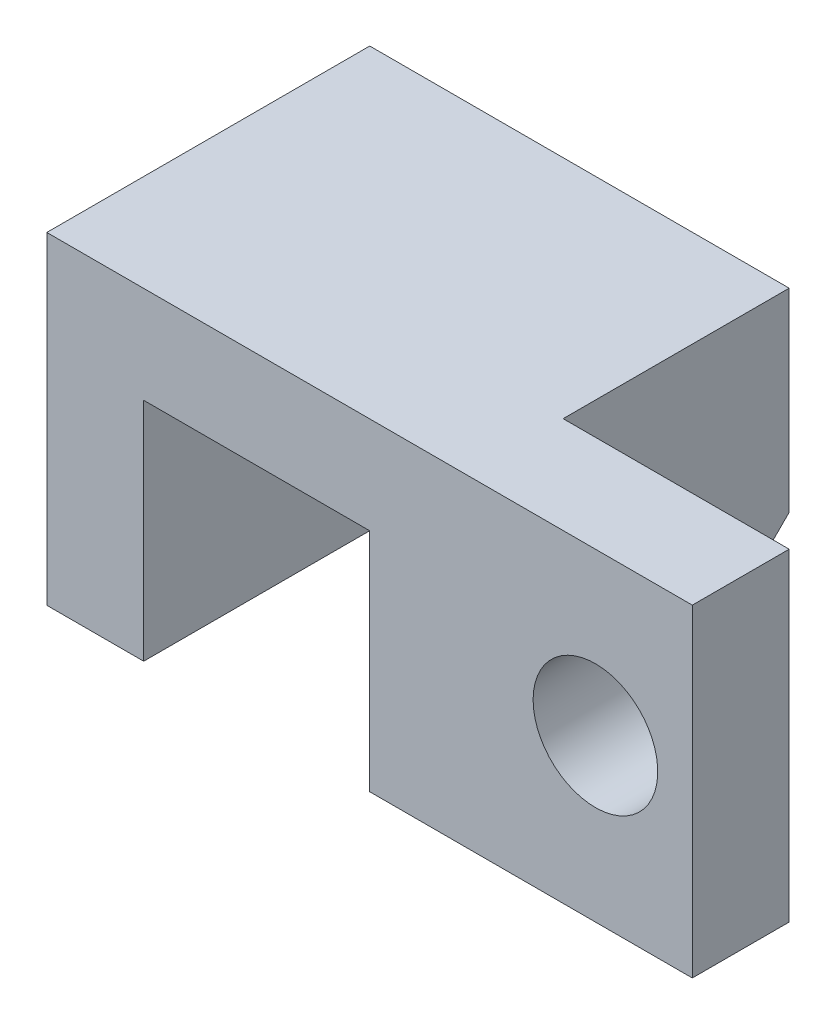
ISO-10303-21;
HEADER;
FILE_DESCRIPTION(('STEP AP214'),'2;1');
FILE_NAME('part.step','',(''),(''),'','','');
FILE_SCHEMA(('AUTOMOTIVE_DESIGN { 1 0 10303 214 1 1 1 1 }'));
ENDSEC;
DATA;
#1=APPLICATION_CONTEXT('core data for automotive mechanical design processes');
#2=APPLICATION_PROTOCOL_DEFINITION('international standard','automotive_design',2000,#1);
#3=PRODUCT_CONTEXT('',#1,'mechanical');
#4=PRODUCT('Part','Part','',(#3));
#5=PRODUCT_RELATED_PRODUCT_CATEGORY('part','',(#4));
#6=PRODUCT_DEFINITION_FORMATION('','',#4);
#7=PRODUCT_DEFINITION_CONTEXT('part definition',#1,'design');
#8=PRODUCT_DEFINITION('design','',#6,#7);
#9=PRODUCT_DEFINITION_SHAPE('','',#8);
#10=(LENGTH_UNIT() NAMED_UNIT(*) SI_UNIT(.MILLI.,.METRE.));
#11=(NAMED_UNIT(*) PLANE_ANGLE_UNIT() SI_UNIT($,.RADIAN.));
#12=(NAMED_UNIT(*) SI_UNIT($,.STERADIAN.) SOLID_ANGLE_UNIT());
#13=UNCERTAINTY_MEASURE_WITH_UNIT(LENGTH_MEASURE(1.E-05),#10,'distance_accuracy_value','');
#14=(GEOMETRIC_REPRESENTATION_CONTEXT(3) GLOBAL_UNCERTAINTY_ASSIGNED_CONTEXT((#13)) GLOBAL_UNIT_ASSIGNED_CONTEXT((#10,
#11,#12)) REPRESENTATION_CONTEXT('',''));
#15=CARTESIAN_POINT('',(0.,0.,0.));
#16=DIRECTION('',(0.,0.,1.));
#17=DIRECTION('',(1.,0.,0.));
#18=AXIS2_PLACEMENT_3D('',#15,#16,#17);
#19=CARTESIAN_POINT('',(-111.704517968308,63.5,-4.67209935395279));
#20=DIRECTION('',(0.,0.,1.));
#21=DIRECTION('',(1.,0.,0.));
#22=AXIS2_PLACEMENT_3D('',#19,#20,#21);
#23=PLANE('',#22);
#24=DIRECTION('',(0.,-1.,0.));
#25=VECTOR('',#24,1.);
#26=CARTESIAN_POINT('',(-111.704517968308,63.5,-4.67209935395279));
#27=LINE('',#26,#25);
#28=CARTESIAN_POINT('',(-111.704517968308,63.5,-4.67209935395279));
#29=VERTEX_POINT('',#28);
#30=CARTESIAN_POINT('',(-111.704517968308,25.3261985511041,-4.67209935395279));
#31=VERTEX_POINT('',#30);
#32=EDGE_CURVE('E129',#29,#31,#27,.T.);
#33=ORIENTED_EDGE('',*,*,#32,.T.);
#34=DIRECTION('',(1.,0.,0.));
#35=VECTOR('',#34,1.);
#36=CARTESIAN_POINT('',(-130.754517968308,25.3261985511041,-4.67209935395279));
#37=LINE('',#36,#35);
#38=CARTESIAN_POINT('',(-130.754517968308,25.3261985511041,-4.67209935395279));
#39=VERTEX_POINT('',#38);
#40=EDGE_CURVE('E119',#39,#31,#37,.T.);
#41=ORIENTED_EDGE('',*,*,#40,.F.);
#42=DIRECTION('',(0.,-1.,0.));
#43=VECTOR('',#42,1.);
#44=CARTESIAN_POINT('',(-130.754517968308,63.5,-4.67209935395279));
#45=LINE('',#44,#43);
#46=CARTESIAN_POINT('',(-130.754517968308,44.4434316630187,-4.67209935395279));
#47=VERTEX_POINT('',#46);
#48=EDGE_CURVE('E11',#47,#39,#45,.T.);
#49=ORIENTED_EDGE('',*,*,#48,.F.);
#50=DIRECTION('',(-1.,0.,0.));
#51=VECTOR('',#50,1.);
#52=CARTESIAN_POINT('',(-130.754517968308,44.4434316630187,-4.67209935395279));
#53=LINE('',#52,#51);
#54=CARTESIAN_POINT('',(-175.135531736741,44.4434316630187,-4.67209935395278));
#55=VERTEX_POINT('',#54);
#56=EDGE_CURVE('E58',#47,#55,#53,.T.);
#57=ORIENTED_EDGE('',*,*,#56,.T.);
#58=DIRECTION('',(0.,-1.,0.));
#59=VECTOR('',#58,1.);
#60=CARTESIAN_POINT('',(-175.135531736741,44.4434316630187,-4.67209935395278));
#61=LINE('',#60,#59);
#62=CARTESIAN_POINT('',(-175.135531736741,0.,-4.67209935395278));
#63=VERTEX_POINT('',#62);
#64=EDGE_CURVE('E223',#55,#63,#61,.T.);
#65=ORIENTED_EDGE('',*,*,#64,.T.);
#66=DIRECTION('',(-1.,0.,0.));
#67=VECTOR('',#66,1.);
#68=CARTESIAN_POINT('',(-175.135531736741,0.,-4.67209935395278));
#69=LINE('',#68,#67);
#70=CARTESIAN_POINT('',(-194.18352201267,0.,-4.67209935395278));
#71=VERTEX_POINT('',#70);
#72=EDGE_CURVE('E227',#63,#71,#69,.T.);
#73=ORIENTED_EDGE('',*,*,#72,.T.);
#74=DIRECTION('',(0.,1.,0.));
#75=VECTOR('',#74,1.);
#76=CARTESIAN_POINT('',(-194.18352201267,0.,-4.67209935395278));
#77=LINE('',#76,#75);
#78=CARTESIAN_POINT('',(-194.18352201267,63.5,-4.67209935395278));
#79=VERTEX_POINT('',#78);
#80=EDGE_CURVE('E211',#71,#79,#77,.T.);
#81=ORIENTED_EDGE('',*,*,#80,.T.);
#82=DIRECTION('',(-1.,0.,0.));
#83=VECTOR('',#82,1.);
#84=CARTESIAN_POINT('',(-111.704517968308,63.5,-4.67209935395279));
#85=LINE('',#84,#83);
#86=EDGE_CURVE('E147',#29,#79,#85,.T.);
#87=ORIENTED_EDGE('',*,*,#86,.F.);
#88=EDGE_LOOP('',(#33,#41,#49,#57,#65,#73,#81,#87));
#89=FACE_BOUND('',#88,.T.);
#90=ADVANCED_FACE('F36',(#89),#23,.F.);
#91=CARTESIAN_POINT('',(-130.754517968308,63.5,-4.67209935395279));
#92=DIRECTION('',(1.,0.,0.));
#93=DIRECTION('',(0.,0.,-1.));
#94=AXIS2_PLACEMENT_3D('',#91,#92,#93);
#95=PLANE('',#94);
#96=ORIENTED_EDGE('',*,*,#48,.T.);
#97=DIRECTION('',(0.,-0.707106781186551,0.707106781186544));
#98=VECTOR('',#97,1.);
#99=CARTESIAN_POINT('',(-130.754517968308,25.3261985511041,-4.67209935395279));
#100=LINE('',#99,#98);
#101=CARTESIAN_POINT('',(-130.754517968308,0.,20.6540991971511));
#102=VERTEX_POINT('',#101);
#103=EDGE_CURVE('E116',#39,#102,#100,.T.);
#104=ORIENTED_EDGE('',*,*,#103,.T.);
#105=DIRECTION('',(0.,0.,1.));
#106=VECTOR('',#105,1.);
#107=CARTESIAN_POINT('',(-130.754517968308,0.,-4.67209935395279));
#108=LINE('',#107,#106);
#109=CARTESIAN_POINT('',(-130.754517968308,0.,58.8279006460472));
#110=VERTEX_POINT('',#109);
#111=EDGE_CURVE('E158',#102,#110,#108,.T.);
#112=ORIENTED_EDGE('',*,*,#111,.T.);
#113=DIRECTION('',(0.,-1.,0.));
#114=VECTOR('',#113,1.);
#115=CARTESIAN_POINT('',(-130.754517968308,63.5,58.8279006460472));
#116=LINE('',#115,#114);
#117=CARTESIAN_POINT('',(-130.754517968308,44.4434316630187,58.8279006460472));
#118=VERTEX_POINT('',#117);
#119=EDGE_CURVE('E43',#118,#110,#116,.T.);
#120=ORIENTED_EDGE('',*,*,#119,.F.);
#121=DIRECTION('',(0.,0.,-1.));
#122=VECTOR('',#121,1.);
#123=CARTESIAN_POINT('',(-130.754517968308,44.4434316630187,58.8279006460472));
#124=LINE('',#123,#122);
#125=EDGE_CURVE('E133',#118,#47,#124,.T.);
#126=ORIENTED_EDGE('',*,*,#125,.T.);
#127=EDGE_LOOP('',(#96,#104,#112,#120,#126));
#128=FACE_BOUND('',#127,.T.);
#129=ADVANCED_FACE('F131',(#128),#95,.F.);
#130=CARTESIAN_POINT('',(-130.754517968308,63.5,58.8279006460472));
#131=DIRECTION('',(0.,0.,-1.));
#132=DIRECTION('',(-1.,0.,0.));
#133=AXIS2_PLACEMENT_3D('',#130,#131,#132);
#134=PLANE('',#133);
#135=CARTESIAN_POINT('',(-86.3045179683084,31.75,58.8279006460472));
#136=DIRECTION('',(0.,0.,-1.));
#137=DIRECTION('',(-1.,0.,0.));
#138=AXIS2_PLACEMENT_3D('',#135,#136,#137);
#139=CIRCLE('',#138,12.2542439066559);
#140=CARTESIAN_POINT('',(-98.5587618749643,31.75,58.8279006460472));
#141=VERTEX_POINT('',#140);
#142=EDGE_CURVE('E224',#141,#141,#139,.T.);
#143=ORIENTED_EDGE('',*,*,#142,.T.);
#144=EDGE_LOOP('',(#143));
#145=FACE_BOUND('',#144,.T.);
#146=DIRECTION('',(1.,0.,0.));
#147=VECTOR('',#146,1.);
#148=CARTESIAN_POINT('',(-130.754517968308,0.,58.8279006460472));
#149=LINE('',#148,#147);
#150=CARTESIAN_POINT('',(-67.2545179683084,0.,58.8279006460472));
#151=VERTEX_POINT('',#150);
#152=EDGE_CURVE('E160',#110,#151,#149,.T.);
#153=ORIENTED_EDGE('',*,*,#152,.T.);
#154=DIRECTION('',(0.,-1.,0.));
#155=VECTOR('',#154,1.);
#156=CARTESIAN_POINT('',(-67.2545179683084,63.5,58.8279006460472));
#157=LINE('',#156,#155);
#158=CARTESIAN_POINT('',(-67.2545179683084,63.5,58.8279006460472));
#159=VERTEX_POINT('',#158);
#160=EDGE_CURVE('E176',#159,#151,#157,.T.);
#161=ORIENTED_EDGE('',*,*,#160,.F.);
#162=DIRECTION('',(1.,0.,0.));
#163=VECTOR('',#162,1.);
#164=CARTESIAN_POINT('',(-130.754517968308,63.5,58.8279006460472));
#165=LINE('',#164,#163);
#166=CARTESIAN_POINT('',(-194.18352201267,63.5,58.8279006460472));
#167=VERTEX_POINT('',#166);
#168=EDGE_CURVE('E149',#167,#159,#165,.T.);
#169=ORIENTED_EDGE('',*,*,#168,.F.);
#170=DIRECTION('',(0.,1.,0.));
#171=VECTOR('',#170,1.);
#172=CARTESIAN_POINT('',(-194.18352201267,0.,58.8279006460472));
#173=LINE('',#172,#171);
#174=CARTESIAN_POINT('',(-194.18352201267,0.,58.8279006460472));
#175=VERTEX_POINT('',#174);
#176=EDGE_CURVE('E138',#175,#167,#173,.T.);
#177=ORIENTED_EDGE('',*,*,#176,.F.);
#178=DIRECTION('',(-1.,0.,0.));
#179=VECTOR('',#178,1.);
#180=CARTESIAN_POINT('',(-175.135531736741,0.,58.8279006460472));
#181=LINE('',#180,#179);
#182=CARTESIAN_POINT('',(-175.135531736741,0.,58.8279006460472));
#183=VERTEX_POINT('',#182);
#184=EDGE_CURVE('E143',#183,#175,#181,.T.);
#185=ORIENTED_EDGE('',*,*,#184,.F.);
#186=DIRECTION('',(0.,-1.,0.));
#187=VECTOR('',#186,1.);
#188=CARTESIAN_POINT('',(-175.135531736741,44.4434316630187,58.8279006460472));
#189=LINE('',#188,#187);
#190=CARTESIAN_POINT('',(-175.135531736741,44.4434316630187,58.8279006460472));
#191=VERTEX_POINT('',#190);
#192=EDGE_CURVE('E217',#191,#183,#189,.T.);
#193=ORIENTED_EDGE('',*,*,#192,.F.);
#194=DIRECTION('',(-1.,0.,0.));
#195=VECTOR('',#194,1.);
#196=CARTESIAN_POINT('',(-130.754517968308,44.4434316630187,58.8279006460472));
#197=LINE('',#196,#195);
#198=EDGE_CURVE('E183',#118,#191,#197,.T.);
#199=ORIENTED_EDGE('',*,*,#198,.F.);
#200=ORIENTED_EDGE('',*,*,#119,.T.);
#201=EDGE_LOOP('',(#153,#161,#169,#177,#185,#193,#199,#200));
#202=FACE_BOUND('',#201,.T.);
#203=ADVANCED_FACE('F180',(#145,#202),#134,.F.);
#204=CARTESIAN_POINT('',(-67.2545179683084,63.5,58.8279006460472));
#205=DIRECTION('',(-1.,0.,0.));
#206=DIRECTION('',(0.,0.,1.));
#207=AXIS2_PLACEMENT_3D('',#204,#205,#206);
#208=PLANE('',#207);
#209=DIRECTION('',(0.,0.,-1.));
#210=VECTOR('',#209,1.);
#211=CARTESIAN_POINT('',(-67.2545179683084,0.,58.8279006460472));
#212=LINE('',#211,#210);
#213=CARTESIAN_POINT('',(-67.2545179683084,0.,39.7779006460472));
#214=VERTEX_POINT('',#213);
#215=EDGE_CURVE('E163',#151,#214,#212,.T.);
#216=ORIENTED_EDGE('',*,*,#215,.T.);
#217=DIRECTION('',(0.,-1.,0.));
#218=VECTOR('',#217,1.);
#219=CARTESIAN_POINT('',(-67.2545179683084,63.5,39.7779006460472));
#220=LINE('',#219,#218);
#221=CARTESIAN_POINT('',(-67.2545179683084,63.5,39.7779006460472));
#222=VERTEX_POINT('',#221);
#223=EDGE_CURVE('E173',#222,#214,#220,.T.);
#224=ORIENTED_EDGE('',*,*,#223,.F.);
#225=DIRECTION('',(0.,0.,-1.));
#226=VECTOR('',#225,1.);
#227=CARTESIAN_POINT('',(-67.2545179683084,63.5,58.8279006460472));
#228=LINE('',#227,#226);
#229=EDGE_CURVE('E152',#159,#222,#228,.T.);
#230=ORIENTED_EDGE('',*,*,#229,.F.);
#231=ORIENTED_EDGE('',*,*,#160,.T.);
#232=EDGE_LOOP('',(#216,#224,#230,#231));
#233=FACE_BOUND('',#232,.T.);
#234=ADVANCED_FACE('F191',(#233),#208,.F.);
#235=CARTESIAN_POINT('',(-67.2545179683084,63.5,39.7779006460472));
#236=DIRECTION('',(0.,0.,1.));
#237=DIRECTION('',(1.,0.,0.));
#238=AXIS2_PLACEMENT_3D('',#235,#236,#237);
#239=PLANE('',#238);
#240=CARTESIAN_POINT('',(-86.3045179683084,31.75,39.7779006460472));
#241=DIRECTION('',(0.,0.,-1.));
#242=DIRECTION('',(-1.,0.,0.));
#243=AXIS2_PLACEMENT_3D('',#240,#241,#242);
#244=CIRCLE('',#243,12.2542439066559);
#245=CARTESIAN_POINT('',(-98.5587618749643,31.75,39.7779006460472));
#246=VERTEX_POINT('',#245);
#247=EDGE_CURVE('E235',#246,#246,#244,.T.);
#248=ORIENTED_EDGE('',*,*,#247,.F.);
#249=EDGE_LOOP('',(#248));
#250=FACE_BOUND('',#249,.T.);
#251=DIRECTION('',(-1.,0.,0.));
#252=VECTOR('',#251,1.);
#253=CARTESIAN_POINT('',(-67.2545179683084,0.,39.7779006460472));
#254=LINE('',#253,#252);
#255=CARTESIAN_POINT('',(-111.704517968308,0.,39.7779006460472));
#256=VERTEX_POINT('',#255);
#257=EDGE_CURVE('E165',#214,#256,#254,.T.);
#258=ORIENTED_EDGE('',*,*,#257,.T.);
#259=DIRECTION('',(0.,-1.,0.));
#260=VECTOR('',#259,1.);
#261=CARTESIAN_POINT('',(-111.704517968308,63.5,39.7779006460472));
#262=LINE('',#261,#260);
#263=CARTESIAN_POINT('',(-111.704517968308,63.5,39.7779006460472));
#264=VERTEX_POINT('',#263);
#265=EDGE_CURVE('E170',#264,#256,#262,.T.);
#266=ORIENTED_EDGE('',*,*,#265,.F.);
#267=DIRECTION('',(-1.,0.,0.));
#268=VECTOR('',#267,1.);
#269=CARTESIAN_POINT('',(-67.2545179683084,63.5,39.7779006460472));
#270=LINE('',#269,#268);
#271=EDGE_CURVE('E154',#222,#264,#270,.T.);
#272=ORIENTED_EDGE('',*,*,#271,.F.);
#273=ORIENTED_EDGE('',*,*,#223,.T.);
#274=EDGE_LOOP('',(#258,#266,#272,#273));
#275=FACE_BOUND('',#274,.T.);
#276=ADVANCED_FACE('F195',(#250,#275),#239,.F.);
#277=CARTESIAN_POINT('',(-111.704517968308,63.5,39.7779006460472));
#278=DIRECTION('',(-1.,0.,0.));
#279=DIRECTION('',(0.,0.,1.));
#280=AXIS2_PLACEMENT_3D('',#277,#278,#279);
#281=PLANE('',#280);
#282=DIRECTION('',(0.,0.,-1.));
#283=VECTOR('',#282,1.);
#284=CARTESIAN_POINT('',(-111.704517968308,0.,39.7779006460472));
#285=LINE('',#284,#283);
#286=CARTESIAN_POINT('',(-111.704517968308,0.,20.6540991971511));
#287=VERTEX_POINT('',#286);
#288=EDGE_CURVE('E150',#256,#287,#285,.T.);
#289=ORIENTED_EDGE('',*,*,#288,.T.);
#290=DIRECTION('',(0.,-0.707106781186551,0.707106781186544));
#291=VECTOR('',#290,1.);
#292=CARTESIAN_POINT('',(-111.704517968308,25.3261985511041,-4.67209935395279));
#293=LINE('',#292,#291);
#294=EDGE_CURVE('E50',#31,#287,#293,.T.);
#295=ORIENTED_EDGE('',*,*,#294,.F.);
#296=ORIENTED_EDGE('',*,*,#32,.F.);
#297=DIRECTION('',(0.,0.,-1.));
#298=VECTOR('',#297,1.);
#299=CARTESIAN_POINT('',(-111.704517968308,63.5,39.7779006460472));
#300=LINE('',#299,#298);
#301=EDGE_CURVE('E156',#264,#29,#300,.T.);
#302=ORIENTED_EDGE('',*,*,#301,.F.);
#303=ORIENTED_EDGE('',*,*,#265,.T.);
#304=EDGE_LOOP('',(#289,#295,#296,#302,#303));
#305=FACE_BOUND('',#304,.T.);
#306=ADVANCED_FACE('F242',(#305),#281,.F.);
#307=CARTESIAN_POINT('',(0.,63.5,0.));
#308=DIRECTION('',(0.,1.,0.));
#309=DIRECTION('',(0.,0.,1.));
#310=AXIS2_PLACEMENT_3D('',#307,#308,#309);
#311=PLANE('',#310);
#312=ORIENTED_EDGE('',*,*,#86,.T.);
#313=DIRECTION('',(0.,0.,-1.));
#314=VECTOR('',#313,1.);
#315=CARTESIAN_POINT('',(-194.18352201267,63.5,58.8279006460472));
#316=LINE('',#315,#314);
#317=EDGE_CURVE('E161',#167,#79,#316,.T.);
#318=ORIENTED_EDGE('',*,*,#317,.F.);
#319=ORIENTED_EDGE('',*,*,#168,.T.);
#320=ORIENTED_EDGE('',*,*,#229,.T.);
#321=ORIENTED_EDGE('',*,*,#271,.T.);
#322=ORIENTED_EDGE('',*,*,#301,.T.);
#323=EDGE_LOOP('',(#312,#318,#319,#320,#321,#322));
#324=FACE_BOUND('',#323,.T.);
#325=ADVANCED_FACE('F199',(#324),#311,.T.);
#326=CARTESIAN_POINT('',(0.,0.,0.));
#327=DIRECTION('',(0.,1.,0.));
#328=DIRECTION('',(0.,0.,1.));
#329=AXIS2_PLACEMENT_3D('',#326,#327,#328);
#330=PLANE('',#329);
#331=ORIENTED_EDGE('',*,*,#111,.F.);
#332=DIRECTION('',(1.,0.,0.));
#333=VECTOR('',#332,1.);
#334=CARTESIAN_POINT('',(-130.754517968308,0.,20.6540991971511));
#335=LINE('',#334,#333);
#336=EDGE_CURVE('E120',#102,#287,#335,.T.);
#337=ORIENTED_EDGE('',*,*,#336,.T.);
#338=ORIENTED_EDGE('',*,*,#288,.F.);
#339=ORIENTED_EDGE('',*,*,#257,.F.);
#340=ORIENTED_EDGE('',*,*,#215,.F.);
#341=ORIENTED_EDGE('',*,*,#152,.F.);
#342=EDGE_LOOP('',(#331,#337,#338,#339,#340,#341));
#343=FACE_BOUND('',#342,.T.);
#344=ADVANCED_FACE('F186',(#343),#330,.F.);
#345=CARTESIAN_POINT('',(-194.18352201267,0.,58.8279006460472));
#346=DIRECTION('',(-1.,0.,0.));
#347=DIRECTION('',(0.,0.,1.));
#348=AXIS2_PLACEMENT_3D('',#345,#346,#347);
#349=PLANE('',#348);
#350=ORIENTED_EDGE('',*,*,#80,.F.);
#351=DIRECTION('',(0.,0.,-1.));
#352=VECTOR('',#351,1.);
#353=CARTESIAN_POINT('',(-194.18352201267,0.,58.8279006460472));
#354=LINE('',#353,#352);
#355=EDGE_CURVE('E210',#175,#71,#354,.T.);
#356=ORIENTED_EDGE('',*,*,#355,.F.);
#357=ORIENTED_EDGE('',*,*,#176,.T.);
#358=ORIENTED_EDGE('',*,*,#317,.T.);
#359=EDGE_LOOP('',(#350,#356,#357,#358));
#360=FACE_BOUND('',#359,.T.);
#361=ADVANCED_FACE('F208',(#360),#349,.T.);
#362=CARTESIAN_POINT('',(-175.135531736741,0.,58.8279006460472));
#363=DIRECTION('',(0.,-1.,0.));
#364=DIRECTION('',(0.,0.,-1.));
#365=AXIS2_PLACEMENT_3D('',#362,#363,#364);
#366=PLANE('',#365);
#367=ORIENTED_EDGE('',*,*,#72,.F.);
#368=DIRECTION('',(0.,0.,-1.));
#369=VECTOR('',#368,1.);
#370=CARTESIAN_POINT('',(-175.135531736741,0.,58.8279006460472));
#371=LINE('',#370,#369);
#372=EDGE_CURVE('E140',#183,#63,#371,.T.);
#373=ORIENTED_EDGE('',*,*,#372,.F.);
#374=ORIENTED_EDGE('',*,*,#184,.T.);
#375=ORIENTED_EDGE('',*,*,#355,.T.);
#376=EDGE_LOOP('',(#367,#373,#374,#375));
#377=FACE_BOUND('',#376,.T.);
#378=ADVANCED_FACE('F216',(#377),#366,.T.);
#379=CARTESIAN_POINT('',(-175.135531736741,44.4434316630187,58.8279006460472));
#380=DIRECTION('',(1.,0.,0.));
#381=DIRECTION('',(0.,0.,-1.));
#382=AXIS2_PLACEMENT_3D('',#379,#380,#381);
#383=PLANE('',#382);
#384=ORIENTED_EDGE('',*,*,#64,.F.);
#385=DIRECTION('',(0.,0.,-1.));
#386=VECTOR('',#385,1.);
#387=CARTESIAN_POINT('',(-175.135531736741,44.4434316630187,58.8279006460472));
#388=LINE('',#387,#386);
#389=EDGE_CURVE('E137',#191,#55,#388,.T.);
#390=ORIENTED_EDGE('',*,*,#389,.F.);
#391=ORIENTED_EDGE('',*,*,#192,.T.);
#392=ORIENTED_EDGE('',*,*,#372,.T.);
#393=EDGE_LOOP('',(#384,#390,#391,#392));
#394=FACE_BOUND('',#393,.T.);
#395=ADVANCED_FACE('F232',(#394),#383,.T.);
#396=CARTESIAN_POINT('',(-130.754517968308,44.4434316630187,58.8279006460472));
#397=DIRECTION('',(0.,-1.,0.));
#398=DIRECTION('',(0.,0.,-1.));
#399=AXIS2_PLACEMENT_3D('',#396,#397,#398);
#400=PLANE('',#399);
#401=ORIENTED_EDGE('',*,*,#56,.F.);
#402=ORIENTED_EDGE('',*,*,#125,.F.);
#403=ORIENTED_EDGE('',*,*,#198,.T.);
#404=ORIENTED_EDGE('',*,*,#389,.T.);
#405=EDGE_LOOP('',(#401,#402,#403,#404));
#406=FACE_BOUND('',#405,.T.);
#407=ADVANCED_FACE('F233',(#406),#400,.T.);
#408=CARTESIAN_POINT('',(-86.3045179683084,31.75,58.8279006460472));
#409=DIRECTION('',(0.,0.,-1.));
#410=DIRECTION('',(-1.,0.,0.));
#411=AXIS2_PLACEMENT_3D('',#408,#409,#410);
#412=CYLINDRICAL_SURFACE('',#411,12.2542439066559);
#413=ORIENTED_EDGE('',*,*,#142,.F.);
#414=EDGE_LOOP('',(#413));
#415=FACE_BOUND('',#414,.T.);
#416=ORIENTED_EDGE('',*,*,#247,.T.);
#417=EDGE_LOOP('',(#416));
#418=FACE_BOUND('',#417,.T.);
#419=ADVANCED_FACE('F282',(#415,#418),#412,.F.);
#420=CARTESIAN_POINT('',(-130.754517968308,25.3261985511041,-4.67209935395279));
#421=DIRECTION('',(0.,0.707106781186544,0.707106781186551));
#422=DIRECTION('',(0.,-0.707106781186551,0.707106781186544));
#423=AXIS2_PLACEMENT_3D('',#420,#421,#422);
#424=PLANE('',#423);
#425=ORIENTED_EDGE('',*,*,#294,.T.);
#426=ORIENTED_EDGE('',*,*,#336,.F.);
#427=ORIENTED_EDGE('',*,*,#103,.F.);
#428=ORIENTED_EDGE('',*,*,#40,.T.);
#429=EDGE_LOOP('',(#425,#426,#427,#428));
#430=FACE_BOUND('',#429,.T.);
#431=ADVANCED_FACE('F118',(#430),#424,.F.);
#432=CLOSED_SHELL('',(#90,#129,#203,#234,#276,#306,#325,#344,#361,#378,#395,#407,#419,#431));
#433=MANIFOLD_SOLID_BREP('B2',#432);
#434=ADVANCED_BREP_SHAPE_REPRESENTATION('',(#18,#433),#14);
#435=SHAPE_DEFINITION_REPRESENTATION(#9,#434);
ENDSEC;
END-ISO-10303-21;
